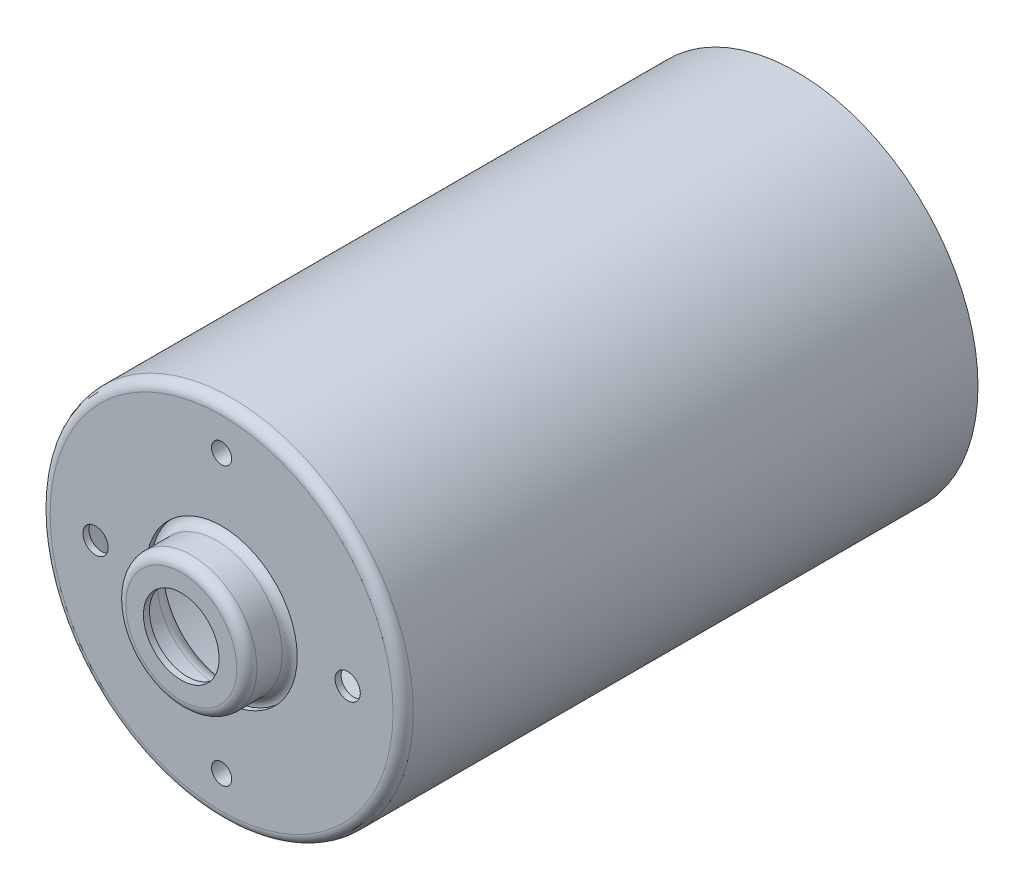
ISO-10303-21;
HEADER;
FILE_DESCRIPTION(('STEP AP214'),'2;1');
FILE_NAME('part.step','',(''),(''),'','','');
FILE_SCHEMA(('AUTOMOTIVE_DESIGN { 1 0 10303 214 1 1 1 1 }'));
ENDSEC;
DATA;
#1=APPLICATION_CONTEXT('core data for automotive mechanical design processes');
#2=APPLICATION_PROTOCOL_DEFINITION('international standard','automotive_design',2000,#1);
#3=PRODUCT_CONTEXT('',#1,'mechanical');
#4=PRODUCT('Part','Part','',(#3));
#5=PRODUCT_RELATED_PRODUCT_CATEGORY('part','',(#4));
#6=PRODUCT_DEFINITION_FORMATION('','',#4);
#7=PRODUCT_DEFINITION_CONTEXT('part definition',#1,'design');
#8=PRODUCT_DEFINITION('design','',#6,#7);
#9=PRODUCT_DEFINITION_SHAPE('','',#8);
#10=(LENGTH_UNIT() NAMED_UNIT(*) SI_UNIT(.MILLI.,.METRE.));
#11=(NAMED_UNIT(*) PLANE_ANGLE_UNIT() SI_UNIT($,.RADIAN.));
#12=(NAMED_UNIT(*) SI_UNIT($,.STERADIAN.) SOLID_ANGLE_UNIT());
#13=UNCERTAINTY_MEASURE_WITH_UNIT(LENGTH_MEASURE(1.E-05),#10,'distance_accuracy_value','');
#14=(GEOMETRIC_REPRESENTATION_CONTEXT(3) GLOBAL_UNCERTAINTY_ASSIGNED_CONTEXT((#13)) GLOBAL_UNIT_ASSIGNED_CONTEXT((#10,
#11,#12)) REPRESENTATION_CONTEXT('',''));
#15=CARTESIAN_POINT('',(0.,0.,0.));
#16=DIRECTION('',(0.,0.,1.));
#17=DIRECTION('',(1.,0.,0.));
#18=AXIS2_PLACEMENT_3D('',#15,#16,#17);
#19=CARTESIAN_POINT('',(0.,0.,31.9));
#20=DIRECTION('',(0.,0.,1.));
#21=DIRECTION('',(1.,0.,0.));
#22=AXIS2_PLACEMENT_3D('',#19,#20,#21);
#23=PLANE('',#22);
#24=CARTESIAN_POINT('',(0.,0.,31.9));
#25=DIRECTION('',(0.,0.,1.));
#26=DIRECTION('',(-1.,0.,0.));
#27=AXIS2_PLACEMENT_3D('',#24,#25,#26);
#28=CIRCLE('',#27,5.5);
#29=CARTESIAN_POINT('',(5.5,0.,31.9));
#30=VERTEX_POINT('',#29);
#31=CARTESIAN_POINT('',(-5.5,0.,31.9));
#32=VERTEX_POINT('',#31);
#33=EDGE_CURVE('E58',#30,#32,#28,.F.);
#34=ORIENTED_EDGE('',*,*,#33,.T.);
#35=CARTESIAN_POINT('',(0.,0.,31.9));
#36=DIRECTION('',(0.,0.,1.));
#37=DIRECTION('',(1.,0.,0.));
#38=AXIS2_PLACEMENT_3D('',#35,#36,#37);
#39=CIRCLE('',#38,5.5);
#40=EDGE_CURVE('E61',#32,#30,#39,.F.);
#41=ORIENTED_EDGE('',*,*,#40,.T.);
#42=EDGE_LOOP('',(#34,#41));
#43=FACE_BOUND('',#42,.T.);
#44=CARTESIAN_POINT('',(0.,0.,31.9));
#45=DIRECTION('',(0.,0.,-1.));
#46=DIRECTION('',(-1.,0.,0.));
#47=AXIS2_PLACEMENT_3D('',#44,#45,#46);
#48=CIRCLE('',#47,3.75);
#49=CARTESIAN_POINT('',(-3.75,0.,31.9));
#50=VERTEX_POINT('',#49);
#51=EDGE_CURVE('E70',#50,#50,#48,.F.);
#52=ORIENTED_EDGE('',*,*,#51,.T.);
#53=EDGE_LOOP('',(#52));
#54=FACE_BOUND('',#53,.T.);
#55=ADVANCED_FACE('F17',(#43,#54),#23,.F.);
#56=CARTESIAN_POINT('',(0.,0.,32.5));
#57=DIRECTION('',(0.,0.,-1.));
#58=DIRECTION('',(-1.,0.,0.));
#59=AXIS2_PLACEMENT_3D('',#56,#57,#58);
#60=CYLINDRICAL_SURFACE('',#59,3.75);
#61=CARTESIAN_POINT('',(0.,0.,32.5));
#62=DIRECTION('',(0.,0.,-1.));
#63=DIRECTION('',(-1.,0.,0.));
#64=AXIS2_PLACEMENT_3D('',#61,#62,#63);
#65=CIRCLE('',#64,3.75);
#66=CARTESIAN_POINT('',(-3.75,0.,32.5));
#67=VERTEX_POINT('',#66);
#68=EDGE_CURVE('E66',#67,#67,#65,.T.);
#69=ORIENTED_EDGE('',*,*,#68,.F.);
#70=EDGE_LOOP('',(#69));
#71=FACE_BOUND('',#70,.T.);
#72=ORIENTED_EDGE('',*,*,#51,.F.);
#73=EDGE_LOOP('',(#72));
#74=FACE_BOUND('',#73,.T.);
#75=ADVANCED_FACE('F520',(#71,#74),#60,.F.);
#76=CARTESIAN_POINT('',(0.,0.,31.5));
#77=DIRECTION('',(0.,0.,1.));
#78=DIRECTION('',(1.,0.,0.));
#79=AXIS2_PLACEMENT_3D('',#76,#77,#78);
#80=TOROIDAL_SURFACE('',#79,5.5,0.4);
#81=CARTESIAN_POINT('',(0.,0.,31.5));
#82=DIRECTION('',(0.,0.,-1.));
#83=DIRECTION('',(-1.,0.,0.));
#84=AXIS2_PLACEMENT_3D('',#81,#82,#83);
#85=CIRCLE('',#84,5.9);
#86=CARTESIAN_POINT('',(-5.9,0.,31.5));
#87=VERTEX_POINT('',#86);
#88=EDGE_CURVE('E136',#87,#87,#85,.T.);
#89=ORIENTED_EDGE('',*,*,#88,.T.);
#90=EDGE_LOOP('',(#89));
#91=FACE_BOUND('',#90,.T.);
#92=ORIENTED_EDGE('',*,*,#33,.F.);
#93=ORIENTED_EDGE('',*,*,#40,.F.);
#94=EDGE_LOOP('',(#92,#93));
#95=FACE_BOUND('',#94,.T.);
#96=ADVANCED_FACE('F69',(#91,#95),#80,.F.);
#97=CARTESIAN_POINT('',(0.,0.,32.5));
#98=DIRECTION('',(0.,0.,1.));
#99=DIRECTION('',(1.,0.,0.));
#100=AXIS2_PLACEMENT_3D('',#97,#98,#99);
#101=PLANE('',#100);
#102=CARTESIAN_POINT('',(0.,0.,32.5));
#103=DIRECTION('',(0.,0.,-1.));
#104=DIRECTION('',(-1.,0.,0.));
#105=AXIS2_PLACEMENT_3D('',#102,#103,#104);
#106=CIRCLE('',#105,5.5);
#107=CARTESIAN_POINT('',(-5.5,0.,32.5));
#108=VERTEX_POINT('',#107);
#109=CARTESIAN_POINT('',(5.5,0.,32.5));
#110=VERTEX_POINT('',#109);
#111=EDGE_CURVE('E107',#108,#110,#106,.T.);
#112=ORIENTED_EDGE('',*,*,#111,.F.);
#113=CARTESIAN_POINT('',(0.,0.,32.5));
#114=DIRECTION('',(0.,0.,-1.));
#115=DIRECTION('',(1.,0.,0.));
#116=AXIS2_PLACEMENT_3D('',#113,#114,#115);
#117=CIRCLE('',#116,5.5);
#118=EDGE_CURVE('E103',#110,#108,#117,.T.);
#119=ORIENTED_EDGE('',*,*,#118,.F.);
#120=EDGE_LOOP('',(#112,#119));
#121=FACE_BOUND('',#120,.T.);
#122=ORIENTED_EDGE('',*,*,#68,.T.);
#123=EDGE_LOOP('',(#122));
#124=FACE_BOUND('',#123,.T.);
#125=ADVANCED_FACE('F113',(#121,#124),#101,.T.);
#126=CARTESIAN_POINT('',(0.,0.,54.8847763108502));
#127=DIRECTION('',(0.,0.,-1.));
#128=DIRECTION('',(-1.,0.,0.));
#129=AXIS2_PLACEMENT_3D('',#126,#127,#128);
#130=CYLINDRICAL_SURFACE('',#129,5.9);
#131=ORIENTED_EDGE('',*,*,#88,.F.);
#132=EDGE_LOOP('',(#131));
#133=FACE_BOUND('',#132,.T.);
#134=CARTESIAN_POINT('',(0.,0.,29.));
#135=DIRECTION('',(0.,0.,1.));
#136=DIRECTION('',(1.,0.,0.));
#137=AXIS2_PLACEMENT_3D('',#134,#135,#136);
#138=CIRCLE('',#137,5.9);
#139=CARTESIAN_POINT('',(5.9,0.,29.));
#140=VERTEX_POINT('',#139);
#141=EDGE_CURVE('E100',#140,#140,#138,.T.);
#142=ORIENTED_EDGE('',*,*,#141,.F.);
#143=EDGE_LOOP('',(#142));
#144=FACE_BOUND('',#143,.T.);
#145=ADVANCED_FACE('F89',(#133,#144),#130,.F.);
#146=CARTESIAN_POINT('',(0.,0.,31.5));
#147=DIRECTION('',(0.,0.,1.));
#148=DIRECTION('',(1.,0.,0.));
#149=AXIS2_PLACEMENT_3D('',#146,#147,#148);
#150=TOROIDAL_SURFACE('',#149,5.5,1.);
#151=CARTESIAN_POINT('',(0.,0.,31.5));
#152=DIRECTION('',(0.,0.,-1.));
#153=DIRECTION('',(-1.,0.,0.));
#154=AXIS2_PLACEMENT_3D('',#151,#152,#153);
#155=CIRCLE('',#154,6.5);
#156=CARTESIAN_POINT('',(-6.5,0.,31.5));
#157=VERTEX_POINT('',#156);
#158=EDGE_CURVE('E98',#157,#157,#155,.T.);
#159=ORIENTED_EDGE('',*,*,#158,.F.);
#160=EDGE_LOOP('',(#159));
#161=FACE_BOUND('',#160,.T.);
#162=ORIENTED_EDGE('',*,*,#118,.T.);
#163=ORIENTED_EDGE('',*,*,#111,.T.);
#164=EDGE_LOOP('',(#162,#163));
#165=FACE_BOUND('',#164,.T.);
#166=ADVANCED_FACE('F77',(#161,#165),#150,.T.);
#167=CARTESIAN_POINT('',(0.,-13.75,25.9));
#168=DIRECTION('',(0.,0.,1.));
#169=DIRECTION('',(1.,0.,0.));
#170=AXIS2_PLACEMENT_3D('',#167,#168,#169);
#171=PLANE('',#170);
#172=CARTESIAN_POINT('',(0.,-13.75,25.9));
#173=DIRECTION('',(0.,0.,1.));
#174=DIRECTION('',(1.,0.,0.));
#175=AXIS2_PLACEMENT_3D('',#172,#173,#174);
#176=CIRCLE('',#175,1.6);
#177=CARTESIAN_POINT('',(1.6,-13.75,25.9));
#178=VERTEX_POINT('',#177);
#179=EDGE_CURVE('E159',#178,#178,#176,.T.);
#180=ORIENTED_EDGE('',*,*,#179,.F.);
#181=EDGE_LOOP('',(#180));
#182=FACE_BOUND('',#181,.T.);
#183=ADVANCED_FACE('F88',(#182),#171,.F.);
#184=CARTESIAN_POINT('',(0.,13.75,25.9));
#185=DIRECTION('',(0.,0.,1.));
#186=DIRECTION('',(1.,0.,0.));
#187=AXIS2_PLACEMENT_3D('',#184,#185,#186);
#188=PLANE('',#187);
#189=CARTESIAN_POINT('',(0.,13.75,25.9));
#190=DIRECTION('',(0.,0.,1.));
#191=DIRECTION('',(1.,0.,0.));
#192=AXIS2_PLACEMENT_3D('',#189,#190,#191);
#193=CIRCLE('',#192,1.6);
#194=CARTESIAN_POINT('',(1.6,13.75,25.9));
#195=VERTEX_POINT('',#194);
#196=EDGE_CURVE('E287',#195,#195,#193,.T.);
#197=ORIENTED_EDGE('',*,*,#196,.F.);
#198=EDGE_LOOP('',(#197));
#199=FACE_BOUND('',#198,.T.);
#200=ADVANCED_FACE('F294',(#199),#188,.F.);
#201=CARTESIAN_POINT('',(0.,0.,29.));
#202=DIRECTION('',(0.,0.,1.));
#203=DIRECTION('',(1.,0.,0.));
#204=AXIS2_PLACEMENT_3D('',#201,#202,#203);
#205=TOROIDAL_SURFACE('',#204,7.5,1.6);
#206=CARTESIAN_POINT('',(0.,0.,27.5167603025809));
#207=DIRECTION('',(0.,0.,1.));
#208=DIRECTION('',(1.,0.,0.));
#209=AXIS2_PLACEMENT_3D('',#206,#207,#208);
#210=CIRCLE('',#209,8.1);
#211=CARTESIAN_POINT('',(8.1,0.,27.5167603025809));
#212=VERTEX_POINT('',#211);
#213=EDGE_CURVE('E285',#212,#212,#210,.T.);
#214=ORIENTED_EDGE('',*,*,#213,.F.);
#215=EDGE_LOOP('',(#214));
#216=FACE_BOUND('',#215,.T.);
#217=ORIENTED_EDGE('',*,*,#141,.T.);
#218=EDGE_LOOP('',(#217));
#219=FACE_BOUND('',#218,.T.);
#220=ADVANCED_FACE('F290',(#216,#219),#205,.T.);
#221=CARTESIAN_POINT('',(0.,0.,54.8847763108502));
#222=DIRECTION('',(0.,0.,-1.));
#223=DIRECTION('',(-1.,0.,0.));
#224=AXIS2_PLACEMENT_3D('',#221,#222,#223);
#225=CYLINDRICAL_SURFACE('',#224,6.5);
#226=ORIENTED_EDGE('',*,*,#158,.T.);
#227=EDGE_LOOP('',(#226));
#228=FACE_BOUND('',#227,.T.);
#229=CARTESIAN_POINT('',(0.,0.,29.));
#230=DIRECTION('',(0.,0.,1.));
#231=DIRECTION('',(1.,0.,0.));
#232=AXIS2_PLACEMENT_3D('',#229,#230,#231);
#233=CIRCLE('',#232,6.5);
#234=CARTESIAN_POINT('',(6.5,0.,29.));
#235=VERTEX_POINT('',#234);
#236=EDGE_CURVE('E281',#235,#235,#233,.T.);
#237=ORIENTED_EDGE('',*,*,#236,.T.);
#238=EDGE_LOOP('',(#237));
#239=FACE_BOUND('',#238,.T.);
#240=ADVANCED_FACE('F293',(#228,#239),#225,.T.);
#241=CARTESIAN_POINT('',(0.,-13.75,26.5));
#242=DIRECTION('',(0.,0.,1.));
#243=DIRECTION('',(1.,0.,0.));
#244=AXIS2_PLACEMENT_3D('',#241,#242,#243);
#245=CYLINDRICAL_SURFACE('',#244,1.6);
#246=CARTESIAN_POINT('',(0.,-13.75,27.9));
#247=DIRECTION('',(0.,0.,1.));
#248=DIRECTION('',(1.,0.,0.));
#249=AXIS2_PLACEMENT_3D('',#246,#247,#248);
#250=CIRCLE('',#249,1.6);
#251=CARTESIAN_POINT('',(1.6,-13.75,27.9));
#252=VERTEX_POINT('',#251);
#253=EDGE_CURVE('E284',#252,#252,#250,.F.);
#254=ORIENTED_EDGE('',*,*,#253,.T.);
#255=EDGE_LOOP('',(#254));
#256=FACE_BOUND('',#255,.T.);
#257=ORIENTED_EDGE('',*,*,#179,.T.);
#258=EDGE_LOOP('',(#257));
#259=FACE_BOUND('',#258,.T.);
#260=ADVANCED_FACE('F366',(#256,#259),#245,.T.);
#261=CARTESIAN_POINT('',(0.,13.75,26.5));
#262=DIRECTION('',(0.,0.,1.));
#263=DIRECTION('',(1.,0.,0.));
#264=AXIS2_PLACEMENT_3D('',#261,#262,#263);
#265=CYLINDRICAL_SURFACE('',#264,1.6);
#266=CARTESIAN_POINT('',(0.,13.75,27.9));
#267=DIRECTION('',(0.,0.,1.));
#268=DIRECTION('',(1.,0.,0.));
#269=AXIS2_PLACEMENT_3D('',#266,#267,#268);
#270=CIRCLE('',#269,1.6);
#271=CARTESIAN_POINT('',(1.6,13.75,27.9));
#272=VERTEX_POINT('',#271);
#273=EDGE_CURVE('E352',#272,#272,#270,.F.);
#274=ORIENTED_EDGE('',*,*,#273,.T.);
#275=EDGE_LOOP('',(#274));
#276=FACE_BOUND('',#275,.T.);
#277=ORIENTED_EDGE('',*,*,#196,.T.);
#278=EDGE_LOOP('',(#277));
#279=FACE_BOUND('',#278,.T.);
#280=ADVANCED_FACE('F451',(#276,#279),#265,.T.);
#281=CARTESIAN_POINT('',(0.,0.,28.));
#282=DIRECTION('',(0.,0.,1.));
#283=DIRECTION('',(1.,0.,0.));
#284=AXIS2_PLACEMENT_3D('',#281,#282,#283);
#285=CYLINDRICAL_SURFACE('',#284,8.1);
#286=CARTESIAN_POINT('',(0.,0.,27.9));
#287=DIRECTION('',(0.,0.,1.));
#288=DIRECTION('',(1.,0.,0.));
#289=AXIS2_PLACEMENT_3D('',#286,#287,#288);
#290=CIRCLE('',#289,8.1);
#291=CARTESIAN_POINT('',(8.1,0.,27.9));
#292=VERTEX_POINT('',#291);
#293=EDGE_CURVE('E349',#292,#292,#290,.F.);
#294=ORIENTED_EDGE('',*,*,#293,.T.);
#295=EDGE_LOOP('',(#294));
#296=FACE_BOUND('',#295,.T.);
#297=ORIENTED_EDGE('',*,*,#213,.T.);
#298=EDGE_LOOP('',(#297));
#299=FACE_BOUND('',#298,.T.);
#300=ADVANCED_FACE('F441',(#296,#299),#285,.T.);
#301=CARTESIAN_POINT('',(0.,-13.75,26.5));
#302=DIRECTION('',(0.,0.,1.));
#303=DIRECTION('',(1.,0.,0.));
#304=AXIS2_PLACEMENT_3D('',#301,#302,#303);
#305=PLANE('',#304);
#306=CARTESIAN_POINT('',(0.,-13.75,26.5));
#307=DIRECTION('',(0.,0.,1.));
#308=DIRECTION('',(1.,0.,0.));
#309=AXIS2_PLACEMENT_3D('',#306,#307,#308);
#310=CIRCLE('',#309,1.);
#311=CARTESIAN_POINT('',(1.,-13.75,26.5));
#312=VERTEX_POINT('',#311);
#313=EDGE_CURVE('E340',#312,#312,#310,.T.);
#314=ORIENTED_EDGE('',*,*,#313,.T.);
#315=EDGE_LOOP('',(#314));
#316=FACE_BOUND('',#315,.T.);
#317=ADVANCED_FACE('F375',(#316),#305,.T.);
#318=CARTESIAN_POINT('',(0.,13.75,26.5));
#319=DIRECTION('',(0.,0.,1.));
#320=DIRECTION('',(1.,0.,0.));
#321=AXIS2_PLACEMENT_3D('',#318,#319,#320);
#322=PLANE('',#321);
#323=CARTESIAN_POINT('',(0.,13.75,26.5));
#324=DIRECTION('',(0.,0.,1.));
#325=DIRECTION('',(1.,0.,0.));
#326=AXIS2_PLACEMENT_3D('',#323,#324,#325);
#327=CIRCLE('',#326,1.);
#328=CARTESIAN_POINT('',(0.999999999999995,13.75,26.5));
#329=VERTEX_POINT('',#328);
#330=EDGE_CURVE('E280',#329,#329,#327,.T.);
#331=ORIENTED_EDGE('',*,*,#330,.T.);
#332=EDGE_LOOP('',(#331));
#333=FACE_BOUND('',#332,.T.);
#334=ADVANCED_FACE('F370',(#333),#322,.T.);
#335=CARTESIAN_POINT('',(0.,0.,29.));
#336=DIRECTION('',(0.,0.,1.));
#337=DIRECTION('',(1.,0.,0.));
#338=AXIS2_PLACEMENT_3D('',#335,#336,#337);
#339=TOROIDAL_SURFACE('',#338,7.5,1.);
#340=CARTESIAN_POINT('',(0.,0.,28.));
#341=DIRECTION('',(0.,0.,1.));
#342=DIRECTION('',(1.,0.,0.));
#343=AXIS2_PLACEMENT_3D('',#340,#341,#342);
#344=CIRCLE('',#343,7.5);
#345=CARTESIAN_POINT('',(7.5,0.,28.));
#346=VERTEX_POINT('',#345);
#347=EDGE_CURVE('E276',#346,#346,#344,.T.);
#348=ORIENTED_EDGE('',*,*,#347,.T.);
#349=EDGE_LOOP('',(#348));
#350=FACE_BOUND('',#349,.T.);
#351=ORIENTED_EDGE('',*,*,#236,.F.);
#352=EDGE_LOOP('',(#351));
#353=FACE_BOUND('',#352,.T.);
#354=ADVANCED_FACE('F251',(#350,#353),#339,.F.);
#355=CARTESIAN_POINT('',(0.,0.,27.9));
#356=DIRECTION('',(0.,0.,1.));
#357=DIRECTION('',(1.,0.,0.));
#358=AXIS2_PLACEMENT_3D('',#355,#356,#357);
#359=PLANE('',#358);
#360=ORIENTED_EDGE('',*,*,#293,.F.);
#361=EDGE_LOOP('',(#360));
#362=FACE_BOUND('',#361,.T.);
#363=ORIENTED_EDGE('',*,*,#273,.F.);
#364=EDGE_LOOP('',(#363));
#365=FACE_BOUND('',#364,.T.);
#366=ORIENTED_EDGE('',*,*,#253,.F.);
#367=EDGE_LOOP('',(#366));
#368=FACE_BOUND('',#367,.T.);
#369=CARTESIAN_POINT('',(0.,0.,27.9));
#370=DIRECTION('',(0.,0.,1.));
#371=DIRECTION('',(-1.,0.,0.));
#372=AXIS2_PLACEMENT_3D('',#369,#370,#371);
#373=CIRCLE('',#372,17.);
#374=CARTESIAN_POINT('',(17.,0.,27.9));
#375=VERTEX_POINT('',#374);
#376=CARTESIAN_POINT('',(-17.,0.,27.9));
#377=VERTEX_POINT('',#376);
#378=EDGE_CURVE('E234',#375,#377,#373,.F.);
#379=ORIENTED_EDGE('',*,*,#378,.T.);
#380=CARTESIAN_POINT('',(0.,0.,27.9));
#381=DIRECTION('',(0.,0.,1.));
#382=DIRECTION('',(1.,0.,0.));
#383=AXIS2_PLACEMENT_3D('',#380,#381,#382);
#384=CIRCLE('',#383,17.);
#385=EDGE_CURVE('E279',#377,#375,#384,.F.);
#386=ORIENTED_EDGE('',*,*,#385,.T.);
#387=EDGE_LOOP('',(#379,#386));
#388=FACE_BOUND('',#387,.T.);
#389=CARTESIAN_POINT('',(12.5,0.,27.9));
#390=DIRECTION('',(0.,0.,1.));
#391=DIRECTION('',(1.,0.,0.));
#392=AXIS2_PLACEMENT_3D('',#389,#390,#391);
#393=CIRCLE('',#392,1.24999999999999);
#394=CARTESIAN_POINT('',(13.75,0.,27.9));
#395=VERTEX_POINT('',#394);
#396=EDGE_CURVE('E343',#395,#395,#393,.T.);
#397=ORIENTED_EDGE('',*,*,#396,.T.);
#398=EDGE_LOOP('',(#397));
#399=FACE_BOUND('',#398,.T.);
#400=CARTESIAN_POINT('',(-12.5,0.,27.9));
#401=DIRECTION('',(0.,0.,1.));
#402=DIRECTION('',(1.,0.,0.));
#403=AXIS2_PLACEMENT_3D('',#400,#401,#402);
#404=CIRCLE('',#403,1.24999999999999);
#405=CARTESIAN_POINT('',(-11.25,0.,27.9));
#406=VERTEX_POINT('',#405);
#407=EDGE_CURVE('E346',#406,#406,#404,.T.);
#408=ORIENTED_EDGE('',*,*,#407,.T.);
#409=EDGE_LOOP('',(#408));
#410=FACE_BOUND('',#409,.T.);
#411=ADVANCED_FACE('F240',(#362,#365,#368,#388,#399,#410),#359,.F.);
#412=CARTESIAN_POINT('',(-12.5,0.,28.5));
#413=DIRECTION('',(0.,0.,1.));
#414=DIRECTION('',(1.,0.,0.));
#415=AXIS2_PLACEMENT_3D('',#412,#413,#414);
#416=CYLINDRICAL_SURFACE('',#415,1.24999999999999);
#417=CARTESIAN_POINT('',(-12.5,0.,28.5));
#418=DIRECTION('',(0.,0.,1.));
#419=DIRECTION('',(1.,0.,0.));
#420=AXIS2_PLACEMENT_3D('',#417,#418,#419);
#421=CIRCLE('',#420,1.24999999999999);
#422=CARTESIAN_POINT('',(-11.25,0.,28.5));
#423=VERTEX_POINT('',#422);
#424=EDGE_CURVE('E335',#423,#423,#421,.F.);
#425=ORIENTED_EDGE('',*,*,#424,.F.);
#426=EDGE_LOOP('',(#425));
#427=FACE_BOUND('',#426,.T.);
#428=ORIENTED_EDGE('',*,*,#407,.F.);
#429=EDGE_LOOP('',(#428));
#430=FACE_BOUND('',#429,.T.);
#431=ADVANCED_FACE('F250',(#427,#430),#416,.F.);
#432=CARTESIAN_POINT('',(12.5,0.,28.5));
#433=DIRECTION('',(0.,0.,1.));
#434=DIRECTION('',(1.,0.,0.));
#435=AXIS2_PLACEMENT_3D('',#432,#433,#434);
#436=CYLINDRICAL_SURFACE('',#435,1.24999999999999);
#437=CARTESIAN_POINT('',(12.5,0.,28.5));
#438=DIRECTION('',(0.,0.,1.));
#439=DIRECTION('',(1.,0.,0.));
#440=AXIS2_PLACEMENT_3D('',#437,#438,#439);
#441=CIRCLE('',#440,1.24999999999999);
#442=CARTESIAN_POINT('',(13.75,0.,28.5));
#443=VERTEX_POINT('',#442);
#444=EDGE_CURVE('E332',#443,#443,#441,.F.);
#445=ORIENTED_EDGE('',*,*,#444,.F.);
#446=EDGE_LOOP('',(#445));
#447=FACE_BOUND('',#446,.T.);
#448=ORIENTED_EDGE('',*,*,#396,.F.);
#449=EDGE_LOOP('',(#448));
#450=FACE_BOUND('',#449,.T.);
#451=ADVANCED_FACE('F393',(#447,#450),#436,.F.);
#452=CARTESIAN_POINT('',(0.,-13.75,26.5));
#453=DIRECTION('',(0.,0.,1.));
#454=DIRECTION('',(1.,0.,0.));
#455=AXIS2_PLACEMENT_3D('',#452,#453,#454);
#456=CYLINDRICAL_SURFACE('',#455,1.);
#457=CARTESIAN_POINT('',(0.,-13.75,28.5));
#458=DIRECTION('',(0.,0.,1.));
#459=DIRECTION('',(1.,0.,0.));
#460=AXIS2_PLACEMENT_3D('',#457,#458,#459);
#461=CIRCLE('',#460,1.);
#462=CARTESIAN_POINT('',(1.,-13.75,28.5));
#463=VERTEX_POINT('',#462);
#464=EDGE_CURVE('E329',#463,#463,#461,.F.);
#465=ORIENTED_EDGE('',*,*,#464,.F.);
#466=EDGE_LOOP('',(#465));
#467=FACE_BOUND('',#466,.T.);
#468=ORIENTED_EDGE('',*,*,#313,.F.);
#469=EDGE_LOOP('',(#468));
#470=FACE_BOUND('',#469,.T.);
#471=ADVANCED_FACE('F387',(#467,#470),#456,.F.);
#472=CARTESIAN_POINT('',(0.,13.75,26.5));
#473=DIRECTION('',(0.,0.,1.));
#474=DIRECTION('',(1.,0.,0.));
#475=AXIS2_PLACEMENT_3D('',#472,#473,#474);
#476=CYLINDRICAL_SURFACE('',#475,1.);
#477=CARTESIAN_POINT('',(0.,13.75,28.5));
#478=DIRECTION('',(0.,0.,1.));
#479=DIRECTION('',(1.,0.,0.));
#480=AXIS2_PLACEMENT_3D('',#477,#478,#479);
#481=CIRCLE('',#480,1.);
#482=CARTESIAN_POINT('',(0.999999999999995,13.75,28.5));
#483=VERTEX_POINT('',#482);
#484=EDGE_CURVE('E326',#483,#483,#481,.F.);
#485=ORIENTED_EDGE('',*,*,#484,.F.);
#486=EDGE_LOOP('',(#485));
#487=FACE_BOUND('',#486,.T.);
#488=ORIENTED_EDGE('',*,*,#330,.F.);
#489=EDGE_LOOP('',(#488));
#490=FACE_BOUND('',#489,.T.);
#491=ADVANCED_FACE('F381',(#487,#490),#476,.F.);
#492=CARTESIAN_POINT('',(0.,0.,28.));
#493=DIRECTION('',(0.,0.,1.));
#494=DIRECTION('',(1.,0.,0.));
#495=AXIS2_PLACEMENT_3D('',#492,#493,#494);
#496=CYLINDRICAL_SURFACE('',#495,7.5);
#497=CARTESIAN_POINT('',(0.,0.,28.5));
#498=DIRECTION('',(0.,0.,1.));
#499=DIRECTION('',(1.,0.,0.));
#500=AXIS2_PLACEMENT_3D('',#497,#498,#499);
#501=CIRCLE('',#500,7.5);
#502=CARTESIAN_POINT('',(7.5,0.,28.5));
#503=VERTEX_POINT('',#502);
#504=EDGE_CURVE('E230',#503,#503,#501,.F.);
#505=ORIENTED_EDGE('',*,*,#504,.F.);
#506=EDGE_LOOP('',(#505));
#507=FACE_BOUND('',#506,.T.);
#508=ORIENTED_EDGE('',*,*,#347,.F.);
#509=EDGE_LOOP('',(#508));
#510=FACE_BOUND('',#509,.T.);
#511=ADVANCED_FACE('F379',(#507,#510),#496,.F.);
#512=CARTESIAN_POINT('',(0.,0.,27.5));
#513=DIRECTION('',(0.,0.,1.));
#514=DIRECTION('',(1.,0.,0.));
#515=AXIS2_PLACEMENT_3D('',#512,#513,#514);
#516=TOROIDAL_SURFACE('',#515,17.,0.4);
#517=ORIENTED_EDGE('',*,*,#378,.F.);
#518=ORIENTED_EDGE('',*,*,#385,.F.);
#519=EDGE_LOOP('',(#517,#518));
#520=FACE_BOUND('',#519,.T.);
#521=CARTESIAN_POINT('',(0.,0.,27.5));
#522=DIRECTION('',(0.,0.,-1.));
#523=DIRECTION('',(-1.,0.,0.));
#524=AXIS2_PLACEMENT_3D('',#521,#522,#523);
#525=CIRCLE('',#524,17.4);
#526=CARTESIAN_POINT('',(-17.4,0.,27.5));
#527=VERTEX_POINT('',#526);
#528=EDGE_CURVE('E227',#527,#527,#525,.T.);
#529=ORIENTED_EDGE('',*,*,#528,.T.);
#530=EDGE_LOOP('',(#529));
#531=FACE_BOUND('',#530,.T.);
#532=ADVANCED_FACE('F204',(#520,#531),#516,.F.);
#533=CARTESIAN_POINT('',(0.,0.,28.5));
#534=DIRECTION('',(0.,0.,1.));
#535=DIRECTION('',(1.,0.,0.));
#536=AXIS2_PLACEMENT_3D('',#533,#534,#535);
#537=PLANE('',#536);
#538=ORIENTED_EDGE('',*,*,#504,.T.);
#539=EDGE_LOOP('',(#538));
#540=FACE_BOUND('',#539,.T.);
#541=ORIENTED_EDGE('',*,*,#484,.T.);
#542=EDGE_LOOP('',(#541));
#543=FACE_BOUND('',#542,.T.);
#544=ORIENTED_EDGE('',*,*,#464,.T.);
#545=EDGE_LOOP('',(#544));
#546=FACE_BOUND('',#545,.T.);
#547=CARTESIAN_POINT('',(0.,0.,28.5));
#548=DIRECTION('',(0.,0.,-1.));
#549=DIRECTION('',(-1.,0.,0.));
#550=AXIS2_PLACEMENT_3D('',#547,#548,#549);
#551=CIRCLE('',#550,17.);
#552=CARTESIAN_POINT('',(-17.,0.,28.5));
#553=VERTEX_POINT('',#552);
#554=CARTESIAN_POINT('',(17.,0.,28.5));
#555=VERTEX_POINT('',#554);
#556=EDGE_CURVE('E191',#553,#555,#551,.T.);
#557=ORIENTED_EDGE('',*,*,#556,.F.);
#558=CARTESIAN_POINT('',(0.,0.,28.5));
#559=DIRECTION('',(0.,0.,-1.));
#560=DIRECTION('',(1.,0.,0.));
#561=AXIS2_PLACEMENT_3D('',#558,#559,#560);
#562=CIRCLE('',#561,17.);
#563=EDGE_CURVE('E37',#555,#553,#562,.T.);
#564=ORIENTED_EDGE('',*,*,#563,.F.);
#565=EDGE_LOOP('',(#557,#564));
#566=FACE_BOUND('',#565,.T.);
#567=ORIENTED_EDGE('',*,*,#444,.T.);
#568=EDGE_LOOP('',(#567));
#569=FACE_BOUND('',#568,.T.);
#570=ORIENTED_EDGE('',*,*,#424,.T.);
#571=EDGE_LOOP('',(#570));
#572=FACE_BOUND('',#571,.T.);
#573=ADVANCED_FACE('F195',(#540,#543,#546,#566,#569,#572),#537,.T.);
#574=CARTESIAN_POINT('',(0.,0.,28.5));
#575=DIRECTION('',(0.,0.,-1.));
#576=DIRECTION('',(-1.,0.,0.));
#577=AXIS2_PLACEMENT_3D('',#574,#575,#576);
#578=CYLINDRICAL_SURFACE('',#577,17.4);
#579=CARTESIAN_POINT('',(0.,0.,-28.5));
#580=DIRECTION('',(0.,0.,-1.));
#581=DIRECTION('',(-1.,0.,0.));
#582=AXIS2_PLACEMENT_3D('',#579,#580,#581);
#583=CIRCLE('',#582,17.4);
#584=CARTESIAN_POINT('',(-17.4,0.,-28.5));
#585=VERTEX_POINT('',#584);
#586=EDGE_CURVE('E317',#585,#585,#583,.T.);
#587=ORIENTED_EDGE('',*,*,#586,.T.);
#588=EDGE_LOOP('',(#587));
#589=FACE_BOUND('',#588,.T.);
#590=ORIENTED_EDGE('',*,*,#528,.F.);
#591=EDGE_LOOP('',(#590));
#592=FACE_BOUND('',#591,.T.);
#593=ADVANCED_FACE('F182',(#589,#592),#578,.F.);
#594=CARTESIAN_POINT('',(0.,0.,27.5));
#595=DIRECTION('',(0.,0.,1.));
#596=DIRECTION('',(1.,0.,0.));
#597=AXIS2_PLACEMENT_3D('',#594,#595,#596);
#598=TOROIDAL_SURFACE('',#597,17.,1.);
#599=ORIENTED_EDGE('',*,*,#563,.T.);
#600=ORIENTED_EDGE('',*,*,#556,.T.);
#601=EDGE_LOOP('',(#599,#600));
#602=FACE_BOUND('',#601,.T.);
#603=CARTESIAN_POINT('',(0.,0.,27.5));
#604=DIRECTION('',(0.,0.,-1.));
#605=DIRECTION('',(-1.,0.,0.));
#606=AXIS2_PLACEMENT_3D('',#603,#604,#605);
#607=CIRCLE('',#606,18.);
#608=CARTESIAN_POINT('',(-18.,0.,27.5));
#609=VERTEX_POINT('',#608);
#610=EDGE_CURVE('E29',#609,#609,#607,.T.);
#611=ORIENTED_EDGE('',*,*,#610,.F.);
#612=EDGE_LOOP('',(#611));
#613=FACE_BOUND('',#612,.T.);
#614=ADVANCED_FACE('F170',(#602,#613),#598,.T.);
#615=CARTESIAN_POINT('',(0.,0.,-28.5));
#616=DIRECTION('',(0.,0.,1.));
#617=DIRECTION('',(1.,0.,0.));
#618=AXIS2_PLACEMENT_3D('',#615,#616,#617);
#619=PLANE('',#618);
#620=CARTESIAN_POINT('',(0.,0.,-28.5));
#621=DIRECTION('',(0.,0.,-1.));
#622=DIRECTION('',(-1.,0.,0.));
#623=AXIS2_PLACEMENT_3D('',#620,#621,#622);
#624=CIRCLE('',#623,18.);
#625=CARTESIAN_POINT('',(-18.,0.,-28.5));
#626=VERTEX_POINT('',#625);
#627=EDGE_CURVE('E11',#626,#626,#624,.F.);
#628=ORIENTED_EDGE('',*,*,#627,.F.);
#629=EDGE_LOOP('',(#628));
#630=FACE_BOUND('',#629,.T.);
#631=ORIENTED_EDGE('',*,*,#586,.F.);
#632=EDGE_LOOP('',(#631));
#633=FACE_BOUND('',#632,.T.);
#634=ADVANCED_FACE('F181',(#630,#633),#619,.F.);
#635=CARTESIAN_POINT('',(0.,0.,28.5));
#636=DIRECTION('',(0.,0.,-1.));
#637=DIRECTION('',(-1.,0.,0.));
#638=AXIS2_PLACEMENT_3D('',#635,#636,#637);
#639=CYLINDRICAL_SURFACE('',#638,18.);
#640=ORIENTED_EDGE('',*,*,#627,.T.);
#641=EDGE_LOOP('',(#640));
#642=FACE_BOUND('',#641,.T.);
#643=ORIENTED_EDGE('',*,*,#610,.T.);
#644=EDGE_LOOP('',(#643));
#645=FACE_BOUND('',#644,.T.);
#646=ADVANCED_FACE('F305',(#642,#645),#639,.T.);
#647=CLOSED_SHELL('',(#55,#75,#96,#125,#145,#166,#183,#200,#220,#240,#260,#280,#300,#317,#334,
#354,#411,#431,#451,#471,#491,#511,#532,#573,#593,#614,#634,#646));
#648=MANIFOLD_SOLID_BREP('B1',#647);
#649=ADVANCED_BREP_SHAPE_REPRESENTATION('',(#18,#648),#14);
#650=SHAPE_DEFINITION_REPRESENTATION(#9,#649);
ENDSEC;
END-ISO-10303-21;
